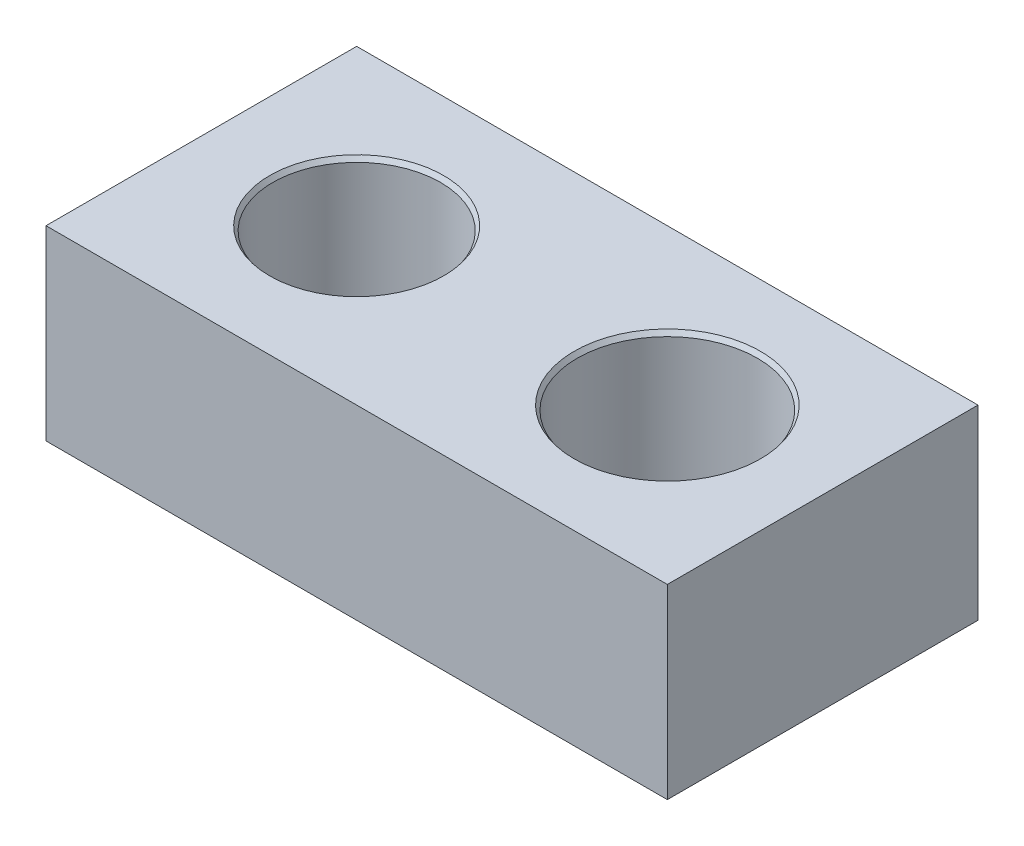
ISO-10303-21;
HEADER;
FILE_DESCRIPTION(('STEP AP214'),'2;1');
FILE_NAME('part.step','',(''),(''),'','','');
FILE_SCHEMA(('AUTOMOTIVE_DESIGN { 1 0 10303 214 1 1 1 1 }'));
ENDSEC;
DATA;
#1=APPLICATION_CONTEXT('core data for automotive mechanical design processes');
#2=APPLICATION_PROTOCOL_DEFINITION('international standard','automotive_design',2000,#1);
#3=PRODUCT_CONTEXT('',#1,'mechanical');
#4=PRODUCT('Part','Part','',(#3));
#5=PRODUCT_RELATED_PRODUCT_CATEGORY('part','',(#4));
#6=PRODUCT_DEFINITION_FORMATION('','',#4);
#7=PRODUCT_DEFINITION_CONTEXT('part definition',#1,'design');
#8=PRODUCT_DEFINITION('design','',#6,#7);
#9=PRODUCT_DEFINITION_SHAPE('','',#8);
#10=(LENGTH_UNIT() NAMED_UNIT(*) SI_UNIT(.MILLI.,.METRE.));
#11=(NAMED_UNIT(*) PLANE_ANGLE_UNIT() SI_UNIT($,.RADIAN.));
#12=(NAMED_UNIT(*) SI_UNIT($,.STERADIAN.) SOLID_ANGLE_UNIT());
#13=UNCERTAINTY_MEASURE_WITH_UNIT(LENGTH_MEASURE(1.E-05),#10,'distance_accuracy_value','');
#14=(GEOMETRIC_REPRESENTATION_CONTEXT(3) GLOBAL_UNCERTAINTY_ASSIGNED_CONTEXT((#13)) GLOBAL_UNIT_ASSIGNED_CONTEXT((#10,
#11,#12)) REPRESENTATION_CONTEXT('',''));
#15=CARTESIAN_POINT('',(0.,0.,0.));
#16=DIRECTION('',(0.,0.,1.));
#17=DIRECTION('',(1.,0.,0.));
#18=AXIS2_PLACEMENT_3D('',#15,#16,#17);
#19=CARTESIAN_POINT('',(0.,0.,0.));
#20=DIRECTION('',(0.,-1.,0.));
#21=DIRECTION('',(0.,0.,-1.));
#22=AXIS2_PLACEMENT_3D('',#19,#20,#21);
#23=PLANE('',#22);
#24=CARTESIAN_POINT('',(15.,0.,-5.));
#25=DIRECTION('',(0.,1.,0.));
#26=DIRECTION('',(0.,0.,1.));
#27=AXIS2_PLACEMENT_3D('',#24,#25,#26);
#28=CIRCLE('',#27,2.9);
#29=CARTESIAN_POINT('',(15.,0.,-2.1));
#30=VERTEX_POINT('',#29);
#31=EDGE_CURVE('E120',#30,#30,#28,.T.);
#32=ORIENTED_EDGE('',*,*,#31,.T.);
#33=EDGE_LOOP('',(#32));
#34=FACE_BOUND('',#33,.T.);
#35=DIRECTION('',(0.,0.,1.));
#36=VECTOR('',#35,1.);
#37=CARTESIAN_POINT('',(0.,0.,0.));
#38=LINE('',#37,#36);
#39=CARTESIAN_POINT('',(0.,0.,-10.));
#40=VERTEX_POINT('',#39);
#41=CARTESIAN_POINT('',(0.,0.,0.));
#42=VERTEX_POINT('',#41);
#43=EDGE_CURVE('E98',#40,#42,#38,.T.);
#44=ORIENTED_EDGE('',*,*,#43,.F.);
#45=DIRECTION('',(-1.,0.,0.));
#46=VECTOR('',#45,1.);
#47=CARTESIAN_POINT('',(0.,0.,-10.));
#48=LINE('',#47,#46);
#49=CARTESIAN_POINT('',(20.,0.,-10.));
#50=VERTEX_POINT('',#49);
#51=EDGE_CURVE('E73',#50,#40,#48,.T.);
#52=ORIENTED_EDGE('',*,*,#51,.F.);
#53=DIRECTION('',(0.,0.,-1.));
#54=VECTOR('',#53,1.);
#55=CARTESIAN_POINT('',(20.,0.,0.));
#56=LINE('',#55,#54);
#57=CARTESIAN_POINT('',(20.,0.,0.));
#58=VERTEX_POINT('',#57);
#59=EDGE_CURVE('E67',#58,#50,#56,.T.);
#60=ORIENTED_EDGE('',*,*,#59,.F.);
#61=DIRECTION('',(1.,0.,0.));
#62=VECTOR('',#61,1.);
#63=CARTESIAN_POINT('',(0.,0.,0.));
#64=LINE('',#63,#62);
#65=EDGE_CURVE('E90',#42,#58,#64,.T.);
#66=ORIENTED_EDGE('',*,*,#65,.F.);
#67=EDGE_LOOP('',(#44,#52,#60,#66));
#68=FACE_BOUND('',#67,.T.);
#69=CARTESIAN_POINT('',(5.,0.,-5.));
#70=DIRECTION('',(0.,1.,0.));
#71=DIRECTION('',(0.,0.,1.));
#72=AXIS2_PLACEMENT_3D('',#69,#70,#71);
#73=CIRCLE('',#72,2.69999999999999);
#74=CARTESIAN_POINT('',(5.,0.,-2.30000000000001));
#75=VERTEX_POINT('',#74);
#76=EDGE_CURVE('E101',#75,#75,#73,.T.);
#77=ORIENTED_EDGE('',*,*,#76,.T.);
#78=EDGE_LOOP('',(#77));
#79=FACE_BOUND('',#78,.T.);
#80=ADVANCED_FACE('F33',(#34,#68,#79),#23,.T.);
#81=CARTESIAN_POINT('',(0.,6.,0.));
#82=DIRECTION('',(0.,-1.,0.));
#83=DIRECTION('',(0.,0.,-1.));
#84=AXIS2_PLACEMENT_3D('',#81,#82,#83);
#85=PLANE('',#84);
#86=CARTESIAN_POINT('',(15.,6.,-5.));
#87=DIRECTION('',(0.,1.,0.));
#88=DIRECTION('',(0.,0.,1.));
#89=AXIS2_PLACEMENT_3D('',#86,#87,#88);
#90=CIRCLE('',#89,3.);
#91=CARTESIAN_POINT('',(15.,6.,-2.));
#92=VERTEX_POINT('',#91);
#93=EDGE_CURVE('E126',#92,#92,#90,.T.);
#94=ORIENTED_EDGE('',*,*,#93,.F.);
#95=EDGE_LOOP('',(#94));
#96=FACE_BOUND('',#95,.T.);
#97=DIRECTION('',(0.,0.,1.));
#98=VECTOR('',#97,1.);
#99=CARTESIAN_POINT('',(0.,6.,0.));
#100=LINE('',#99,#98);
#101=CARTESIAN_POINT('',(0.,6.,-10.));
#102=VERTEX_POINT('',#101);
#103=CARTESIAN_POINT('',(0.,6.,0.));
#104=VERTEX_POINT('',#103);
#105=EDGE_CURVE('E86',#102,#104,#100,.T.);
#106=ORIENTED_EDGE('',*,*,#105,.T.);
#107=DIRECTION('',(1.,0.,0.));
#108=VECTOR('',#107,1.);
#109=CARTESIAN_POINT('',(0.,6.,0.));
#110=LINE('',#109,#108);
#111=CARTESIAN_POINT('',(20.,6.,0.));
#112=VERTEX_POINT('',#111);
#113=EDGE_CURVE('E80',#104,#112,#110,.T.);
#114=ORIENTED_EDGE('',*,*,#113,.T.);
#115=DIRECTION('',(0.,0.,-1.));
#116=VECTOR('',#115,1.);
#117=CARTESIAN_POINT('',(20.,6.,0.));
#118=LINE('',#117,#116);
#119=CARTESIAN_POINT('',(20.,6.,-10.));
#120=VERTEX_POINT('',#119);
#121=EDGE_CURVE('E84',#112,#120,#118,.T.);
#122=ORIENTED_EDGE('',*,*,#121,.T.);
#123=DIRECTION('',(-1.,0.,0.));
#124=VECTOR('',#123,1.);
#125=CARTESIAN_POINT('',(0.,6.,-10.));
#126=LINE('',#125,#124);
#127=EDGE_CURVE('E50',#120,#102,#126,.T.);
#128=ORIENTED_EDGE('',*,*,#127,.T.);
#129=EDGE_LOOP('',(#106,#114,#122,#128));
#130=FACE_BOUND('',#129,.T.);
#131=CARTESIAN_POINT('',(5.,6.,-5.));
#132=DIRECTION('',(0.,1.,0.));
#133=DIRECTION('',(0.,0.,1.));
#134=AXIS2_PLACEMENT_3D('',#131,#132,#133);
#135=CIRCLE('',#134,2.8);
#136=CARTESIAN_POINT('',(5.,6.,-2.2));
#137=VERTEX_POINT('',#136);
#138=EDGE_CURVE('E117',#137,#137,#135,.T.);
#139=ORIENTED_EDGE('',*,*,#138,.F.);
#140=EDGE_LOOP('',(#139));
#141=FACE_BOUND('',#140,.T.);
#142=ADVANCED_FACE('F81',(#96,#130,#141),#85,.F.);
#143=CARTESIAN_POINT('',(0.,6.,0.));
#144=DIRECTION('',(1.,0.,0.));
#145=DIRECTION('',(0.,0.,-1.));
#146=AXIS2_PLACEMENT_3D('',#143,#144,#145);
#147=PLANE('',#146);
#148=ORIENTED_EDGE('',*,*,#43,.T.);
#149=DIRECTION('',(0.,-1.,0.));
#150=VECTOR('',#149,1.);
#151=CARTESIAN_POINT('',(0.,6.,0.));
#152=LINE('',#151,#150);
#153=EDGE_CURVE('E11',#104,#42,#152,.T.);
#154=ORIENTED_EDGE('',*,*,#153,.F.);
#155=ORIENTED_EDGE('',*,*,#105,.F.);
#156=DIRECTION('',(0.,-1.,0.));
#157=VECTOR('',#156,1.);
#158=CARTESIAN_POINT('',(0.,6.,-10.));
#159=LINE('',#158,#157);
#160=EDGE_CURVE('E94',#102,#40,#159,.T.);
#161=ORIENTED_EDGE('',*,*,#160,.T.);
#162=EDGE_LOOP('',(#148,#154,#155,#161));
#163=FACE_BOUND('',#162,.T.);
#164=ADVANCED_FACE('F35',(#163),#147,.F.);
#165=CARTESIAN_POINT('',(0.,6.,0.));
#166=DIRECTION('',(0.,0.,-1.));
#167=DIRECTION('',(-1.,0.,0.));
#168=AXIS2_PLACEMENT_3D('',#165,#166,#167);
#169=PLANE('',#168);
#170=ORIENTED_EDGE('',*,*,#65,.T.);
#171=DIRECTION('',(0.,-1.,0.));
#172=VECTOR('',#171,1.);
#173=CARTESIAN_POINT('',(20.,6.,0.));
#174=LINE('',#173,#172);
#175=EDGE_CURVE('E42',#112,#58,#174,.T.);
#176=ORIENTED_EDGE('',*,*,#175,.F.);
#177=ORIENTED_EDGE('',*,*,#113,.F.);
#178=ORIENTED_EDGE('',*,*,#153,.T.);
#179=EDGE_LOOP('',(#170,#176,#177,#178));
#180=FACE_BOUND('',#179,.T.);
#181=ADVANCED_FACE('F89',(#180),#169,.F.);
#182=CARTESIAN_POINT('',(20.,6.,0.));
#183=DIRECTION('',(-1.,0.,0.));
#184=DIRECTION('',(0.,0.,1.));
#185=AXIS2_PLACEMENT_3D('',#182,#183,#184);
#186=PLANE('',#185);
#187=ORIENTED_EDGE('',*,*,#59,.T.);
#188=DIRECTION('',(0.,-1.,0.));
#189=VECTOR('',#188,1.);
#190=CARTESIAN_POINT('',(20.,6.,-10.));
#191=LINE('',#190,#189);
#192=EDGE_CURVE('E91',#120,#50,#191,.T.);
#193=ORIENTED_EDGE('',*,*,#192,.F.);
#194=ORIENTED_EDGE('',*,*,#121,.F.);
#195=ORIENTED_EDGE('',*,*,#175,.T.);
#196=EDGE_LOOP('',(#187,#193,#194,#195));
#197=FACE_BOUND('',#196,.T.);
#198=ADVANCED_FACE('F92',(#197),#186,.F.);
#199=CARTESIAN_POINT('',(0.,6.,-10.));
#200=DIRECTION('',(0.,0.,1.));
#201=DIRECTION('',(1.,0.,0.));
#202=AXIS2_PLACEMENT_3D('',#199,#200,#201);
#203=PLANE('',#202);
#204=ORIENTED_EDGE('',*,*,#51,.T.);
#205=ORIENTED_EDGE('',*,*,#160,.F.);
#206=ORIENTED_EDGE('',*,*,#127,.F.);
#207=ORIENTED_EDGE('',*,*,#192,.T.);
#208=EDGE_LOOP('',(#204,#205,#206,#207));
#209=FACE_BOUND('',#208,.T.);
#210=ADVANCED_FACE('F106',(#209),#203,.F.);
#211=CARTESIAN_POINT('',(5.,6.,-5.));
#212=DIRECTION('',(0.,1.,0.));
#213=DIRECTION('',(0.,0.,1.));
#214=AXIS2_PLACEMENT_3D('',#211,#212,#213);
#215=CYLINDRICAL_SURFACE('',#214,2.69999999999999);
#216=ORIENTED_EDGE('',*,*,#76,.F.);
#217=EDGE_LOOP('',(#216));
#218=FACE_BOUND('',#217,.T.);
#219=CARTESIAN_POINT('',(5.,5.85718519932579,-5.));
#220=DIRECTION('',(0.,1.,0.));
#221=DIRECTION('',(0.,0.,1.));
#222=AXIS2_PLACEMENT_3D('',#219,#220,#221);
#223=CIRCLE('',#222,2.7);
#224=CARTESIAN_POINT('',(5.,5.85718519932579,-2.3));
#225=VERTEX_POINT('',#224);
#226=EDGE_CURVE('E114',#225,#225,#223,.T.);
#227=ORIENTED_EDGE('',*,*,#226,.T.);
#228=EDGE_LOOP('',(#227));
#229=FACE_BOUND('',#228,.T.);
#230=ADVANCED_FACE('F141',(#218,#229),#215,.F.);
#231=CARTESIAN_POINT('',(5.,6.,-5.));
#232=DIRECTION('',(0.,1.,0.));
#233=DIRECTION('',(0.,0.,1.));
#234=AXIS2_PLACEMENT_3D('',#231,#232,#233);
#235=CONICAL_SURFACE('',#234,2.8,0.61086523819801);
#236=ORIENTED_EDGE('',*,*,#226,.F.);
#237=EDGE_LOOP('',(#236));
#238=FACE_BOUND('',#237,.T.);
#239=ORIENTED_EDGE('',*,*,#138,.T.);
#240=EDGE_LOOP('',(#239));
#241=FACE_BOUND('',#240,.T.);
#242=ADVANCED_FACE('F166',(#238,#241),#235,.F.);
#243=CARTESIAN_POINT('',(15.,6.,-5.));
#244=DIRECTION('',(0.,1.,0.));
#245=DIRECTION('',(0.,0.,1.));
#246=AXIS2_PLACEMENT_3D('',#243,#244,#245);
#247=CYLINDRICAL_SURFACE('',#246,2.9);
#248=ORIENTED_EDGE('',*,*,#31,.F.);
#249=EDGE_LOOP('',(#248));
#250=FACE_BOUND('',#249,.T.);
#251=CARTESIAN_POINT('',(15.,5.85718519932578,-5.));
#252=DIRECTION('',(0.,1.,0.));
#253=DIRECTION('',(0.,0.,1.));
#254=AXIS2_PLACEMENT_3D('',#251,#252,#253);
#255=CIRCLE('',#254,2.9);
#256=CARTESIAN_POINT('',(15.,5.85718519932578,-2.1));
#257=VERTEX_POINT('',#256);
#258=EDGE_CURVE('E123',#257,#257,#255,.T.);
#259=ORIENTED_EDGE('',*,*,#258,.T.);
#260=EDGE_LOOP('',(#259));
#261=FACE_BOUND('',#260,.T.);
#262=ADVANCED_FACE('F173',(#250,#261),#247,.F.);
#263=CARTESIAN_POINT('',(15.,6.,-5.));
#264=DIRECTION('',(0.,1.,0.));
#265=DIRECTION('',(0.,0.,1.));
#266=AXIS2_PLACEMENT_3D('',#263,#264,#265);
#267=CONICAL_SURFACE('',#266,3.,0.610865238198001);
#268=ORIENTED_EDGE('',*,*,#258,.F.);
#269=EDGE_LOOP('',(#268));
#270=FACE_BOUND('',#269,.T.);
#271=ORIENTED_EDGE('',*,*,#93,.T.);
#272=EDGE_LOOP('',(#271));
#273=FACE_BOUND('',#272,.T.);
#274=ADVANCED_FACE('F130',(#270,#273),#267,.F.);
#275=CLOSED_SHELL('',(#80,#142,#164,#181,#198,#210,#230,#242,#262,#274));
#276=MANIFOLD_SOLID_BREP('B2',#275);
#277=ADVANCED_BREP_SHAPE_REPRESENTATION('',(#18,#276),#14);
#278=SHAPE_DEFINITION_REPRESENTATION(#9,#277);
ENDSEC;
END-ISO-10303-21;
